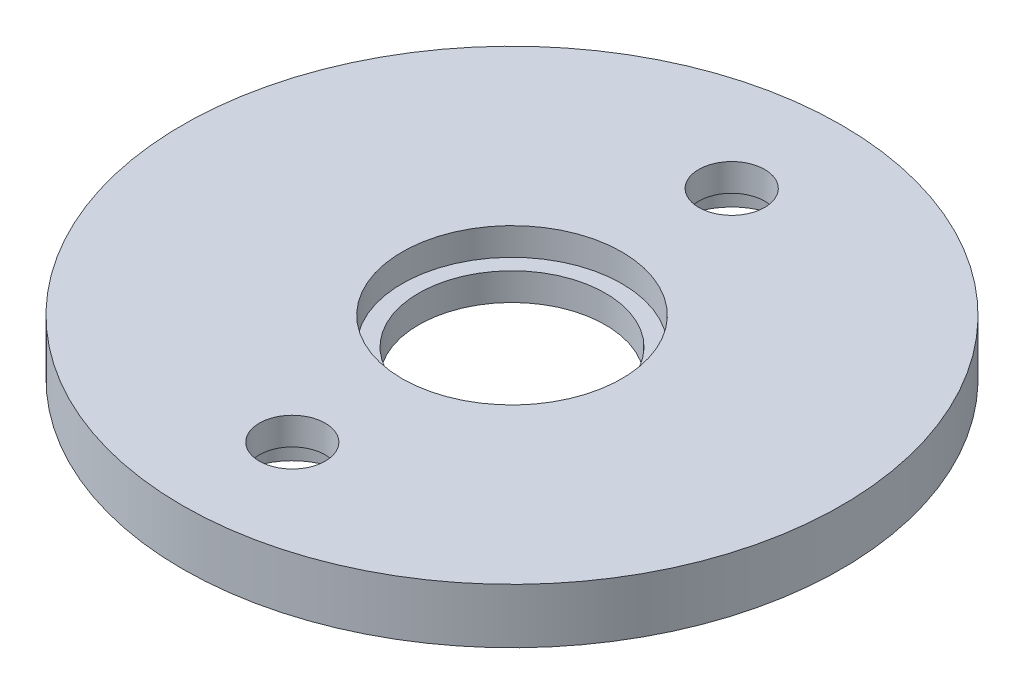
ISO-10303-21;
HEADER;
FILE_DESCRIPTION(('STEP AP214'),'2;1');
FILE_NAME('part.step','',(''),(''),'','','');
FILE_SCHEMA(('AUTOMOTIVE_DESIGN { 1 0 10303 214 1 1 1 1 }'));
ENDSEC;
DATA;
#1=APPLICATION_CONTEXT('core data for automotive mechanical design processes');
#2=APPLICATION_PROTOCOL_DEFINITION('international standard','automotive_design',2000,#1);
#3=PRODUCT_CONTEXT('',#1,'mechanical');
#4=PRODUCT('Part','Part','',(#3));
#5=PRODUCT_RELATED_PRODUCT_CATEGORY('part','',(#4));
#6=PRODUCT_DEFINITION_FORMATION('','',#4);
#7=PRODUCT_DEFINITION_CONTEXT('part definition',#1,'design');
#8=PRODUCT_DEFINITION('design','',#6,#7);
#9=PRODUCT_DEFINITION_SHAPE('','',#8);
#10=(LENGTH_UNIT() NAMED_UNIT(*) SI_UNIT(.MILLI.,.METRE.));
#11=(NAMED_UNIT(*) PLANE_ANGLE_UNIT() SI_UNIT($,.RADIAN.));
#12=(NAMED_UNIT(*) SI_UNIT($,.STERADIAN.) SOLID_ANGLE_UNIT());
#13=UNCERTAINTY_MEASURE_WITH_UNIT(LENGTH_MEASURE(1.E-05),#10,'distance_accuracy_value','');
#14=(GEOMETRIC_REPRESENTATION_CONTEXT(3) GLOBAL_UNCERTAINTY_ASSIGNED_CONTEXT((#13)) GLOBAL_UNIT_ASSIGNED_CONTEXT((#10,
#11,#12)) REPRESENTATION_CONTEXT('',''));
#15=CARTESIAN_POINT('',(0.,0.,0.));
#16=DIRECTION('',(0.,0.,1.));
#17=DIRECTION('',(1.,0.,0.));
#18=AXIS2_PLACEMENT_3D('',#15,#16,#17);
#19=CARTESIAN_POINT('',(0.,1.,0.));
#20=DIRECTION('',(0.,-1.,0.));
#21=DIRECTION('',(0.,0.,-1.));
#22=AXIS2_PLACEMENT_3D('',#19,#20,#21);
#23=CYLINDRICAL_SURFACE('',#22,1.7);
#24=CARTESIAN_POINT('',(0.,0.,0.));
#25=DIRECTION('',(0.,1.,0.));
#26=DIRECTION('',(0.,0.,1.));
#27=AXIS2_PLACEMENT_3D('',#24,#25,#26);
#28=CIRCLE('',#27,1.7);
#29=CARTESIAN_POINT('',(0.,0.,1.7));
#30=VERTEX_POINT('',#29);
#31=EDGE_CURVE('E56',#30,#30,#28,.T.);
#32=ORIENTED_EDGE('',*,*,#31,.F.);
#33=EDGE_LOOP('',(#32));
#34=FACE_BOUND('',#33,.T.);
#35=CARTESIAN_POINT('',(0.,0.5,0.));
#36=DIRECTION('',(0.,1.,0.));
#37=DIRECTION('',(0.,0.,1.));
#38=AXIS2_PLACEMENT_3D('',#35,#36,#37);
#39=CIRCLE('',#38,1.7);
#40=CARTESIAN_POINT('',(0.,0.5,1.7));
#41=VERTEX_POINT('',#40);
#42=EDGE_CURVE('E47',#41,#41,#39,.T.);
#43=ORIENTED_EDGE('',*,*,#42,.T.);
#44=EDGE_LOOP('',(#43));
#45=FACE_BOUND('',#44,.T.);
#46=ADVANCED_FACE('F44',(#34,#45),#23,.F.);
#47=CARTESIAN_POINT('',(0.,0.,0.));
#48=DIRECTION('',(0.,1.,0.));
#49=DIRECTION('',(0.,0.,1.));
#50=AXIS2_PLACEMENT_3D('',#47,#48,#49);
#51=PLANE('',#50);
#52=ORIENTED_EDGE('',*,*,#31,.T.);
#53=EDGE_LOOP('',(#52));
#54=FACE_BOUND('',#53,.T.);
#55=CARTESIAN_POINT('',(0.,0.,0.));
#56=DIRECTION('',(0.,1.,0.));
#57=DIRECTION('',(0.,0.,1.));
#58=AXIS2_PLACEMENT_3D('',#55,#56,#57);
#59=CIRCLE('',#58,6.);
#60=CARTESIAN_POINT('',(0.,0.,6.));
#61=VERTEX_POINT('',#60);
#62=EDGE_CURVE('E51',#61,#61,#59,.T.);
#63=ORIENTED_EDGE('',*,*,#62,.F.);
#64=EDGE_LOOP('',(#63));
#65=FACE_BOUND('',#64,.T.);
#66=CARTESIAN_POINT('',(0.,0.,-4.));
#67=DIRECTION('',(0.,1.,0.));
#68=DIRECTION('',(0.,0.,1.));
#69=AXIS2_PLACEMENT_3D('',#66,#67,#68);
#70=CIRCLE('',#69,1.);
#71=CARTESIAN_POINT('',(0.,0.,-3.));
#72=VERTEX_POINT('',#71);
#73=EDGE_CURVE('E71',#72,#72,#70,.T.);
#74=ORIENTED_EDGE('',*,*,#73,.T.);
#75=EDGE_LOOP('',(#74));
#76=FACE_BOUND('',#75,.T.);
#77=CARTESIAN_POINT('',(0.,0.,4.));
#78=DIRECTION('',(0.,1.,0.));
#79=DIRECTION('',(0.,0.,1.));
#80=AXIS2_PLACEMENT_3D('',#77,#78,#79);
#81=CIRCLE('',#80,1.);
#82=CARTESIAN_POINT('',(0.,0.,5.));
#83=VERTEX_POINT('',#82);
#84=EDGE_CURVE('E78',#83,#83,#81,.F.);
#85=ORIENTED_EDGE('',*,*,#84,.F.);
#86=EDGE_LOOP('',(#85));
#87=FACE_BOUND('',#86,.T.);
#88=ADVANCED_FACE('F101',(#54,#65,#76,#87),#51,.F.);
#89=CARTESIAN_POINT('',(0.,1.,0.));
#90=DIRECTION('',(0.,1.,0.));
#91=DIRECTION('',(0.,0.,1.));
#92=AXIS2_PLACEMENT_3D('',#89,#90,#91);
#93=PLANE('',#92);
#94=CARTESIAN_POINT('',(0.,1.,0.));
#95=DIRECTION('',(0.,1.,0.));
#96=DIRECTION('',(0.,0.,1.));
#97=AXIS2_PLACEMENT_3D('',#94,#95,#96);
#98=CIRCLE('',#97,2.);
#99=CARTESIAN_POINT('',(0.,1.,2.));
#100=VERTEX_POINT('',#99);
#101=EDGE_CURVE('E91',#100,#100,#98,.T.);
#102=ORIENTED_EDGE('',*,*,#101,.F.);
#103=EDGE_LOOP('',(#102));
#104=FACE_BOUND('',#103,.T.);
#105=CARTESIAN_POINT('',(0.,1.,-4.));
#106=DIRECTION('',(0.,1.,0.));
#107=DIRECTION('',(0.,0.,1.));
#108=AXIS2_PLACEMENT_3D('',#105,#106,#107);
#109=CIRCLE('',#108,0.6);
#110=CARTESIAN_POINT('',(0.,1.,-3.4));
#111=VERTEX_POINT('',#110);
#112=EDGE_CURVE('E59',#111,#111,#109,.T.);
#113=ORIENTED_EDGE('',*,*,#112,.F.);
#114=EDGE_LOOP('',(#113));
#115=FACE_BOUND('',#114,.T.);
#116=CARTESIAN_POINT('',(0.,1.,0.));
#117=DIRECTION('',(0.,1.,0.));
#118=DIRECTION('',(0.,0.,1.));
#119=AXIS2_PLACEMENT_3D('',#116,#117,#118);
#120=CIRCLE('',#119,6.);
#121=CARTESIAN_POINT('',(0.,1.,6.));
#122=VERTEX_POINT('',#121);
#123=EDGE_CURVE('E11',#122,#122,#120,.T.);
#124=ORIENTED_EDGE('',*,*,#123,.T.);
#125=EDGE_LOOP('',(#124));
#126=FACE_BOUND('',#125,.T.);
#127=CARTESIAN_POINT('',(0.,1.,4.));
#128=DIRECTION('',(0.,1.,0.));
#129=DIRECTION('',(0.,0.,1.));
#130=AXIS2_PLACEMENT_3D('',#127,#128,#129);
#131=CIRCLE('',#130,0.6);
#132=CARTESIAN_POINT('',(0.,1.,4.6));
#133=VERTEX_POINT('',#132);
#134=EDGE_CURVE('E62',#133,#133,#131,.F.);
#135=ORIENTED_EDGE('',*,*,#134,.T.);
#136=EDGE_LOOP('',(#135));
#137=FACE_BOUND('',#136,.T.);
#138=ADVANCED_FACE('F97',(#104,#115,#126,#137),#93,.T.);
#139=CARTESIAN_POINT('',(0.,1.,0.));
#140=DIRECTION('',(0.,-1.,0.));
#141=DIRECTION('',(0.,0.,-1.));
#142=AXIS2_PLACEMENT_3D('',#139,#140,#141);
#143=CYLINDRICAL_SURFACE('',#142,6.);
#144=ORIENTED_EDGE('',*,*,#123,.F.);
#145=EDGE_LOOP('',(#144));
#146=FACE_BOUND('',#145,.T.);
#147=ORIENTED_EDGE('',*,*,#62,.T.);
#148=EDGE_LOOP('',(#147));
#149=FACE_BOUND('',#148,.T.);
#150=ADVANCED_FACE('F100',(#146,#149),#143,.T.);
#151=CARTESIAN_POINT('',(0.,1.,-4.));
#152=DIRECTION('',(0.,-1.,0.));
#153=DIRECTION('',(0.,0.,-1.));
#154=AXIS2_PLACEMENT_3D('',#151,#152,#153);
#155=CYLINDRICAL_SURFACE('',#154,0.6);
#156=CARTESIAN_POINT('',(0.,0.5,-4.));
#157=DIRECTION('',(0.,1.,0.));
#158=DIRECTION('',(0.,0.,1.));
#159=AXIS2_PLACEMENT_3D('',#156,#157,#158);
#160=CIRCLE('',#159,0.6);
#161=CARTESIAN_POINT('',(0.,0.5,-3.4));
#162=VERTEX_POINT('',#161);
#163=EDGE_CURVE('E74',#162,#162,#160,.T.);
#164=ORIENTED_EDGE('',*,*,#163,.F.);
#165=EDGE_LOOP('',(#164));
#166=FACE_BOUND('',#165,.T.);
#167=ORIENTED_EDGE('',*,*,#112,.T.);
#168=EDGE_LOOP('',(#167));
#169=FACE_BOUND('',#168,.T.);
#170=ADVANCED_FACE('F105',(#166,#169),#155,.F.);
#171=CARTESIAN_POINT('',(0.,1.,4.));
#172=DIRECTION('',(0.,-1.,0.));
#173=DIRECTION('',(0.,0.,-1.));
#174=AXIS2_PLACEMENT_3D('',#171,#172,#173);
#175=CYLINDRICAL_SURFACE('',#174,0.6);
#176=CARTESIAN_POINT('',(0.,0.5,4.));
#177=DIRECTION('',(0.,1.,0.));
#178=DIRECTION('',(0.,0.,1.));
#179=AXIS2_PLACEMENT_3D('',#176,#177,#178);
#180=CIRCLE('',#179,0.6);
#181=CARTESIAN_POINT('',(0.,0.5,4.6));
#182=VERTEX_POINT('',#181);
#183=EDGE_CURVE('E69',#182,#182,#180,.F.);
#184=ORIENTED_EDGE('',*,*,#183,.T.);
#185=EDGE_LOOP('',(#184));
#186=FACE_BOUND('',#185,.T.);
#187=ORIENTED_EDGE('',*,*,#134,.F.);
#188=EDGE_LOOP('',(#187));
#189=FACE_BOUND('',#188,.T.);
#190=ADVANCED_FACE('F107',(#186,#189),#175,.F.);
#191=CARTESIAN_POINT('',(0.,0.5,4.));
#192=DIRECTION('',(0.,-1.,0.));
#193=DIRECTION('',(0.,0.,-1.));
#194=AXIS2_PLACEMENT_3D('',#191,#192,#193);
#195=CYLINDRICAL_SURFACE('',#194,1.);
#196=CARTESIAN_POINT('',(0.,0.5,4.));
#197=DIRECTION('',(0.,1.,0.));
#198=DIRECTION('',(0.,0.,1.));
#199=AXIS2_PLACEMENT_3D('',#196,#197,#198);
#200=CIRCLE('',#199,1.);
#201=CARTESIAN_POINT('',(0.,0.5,5.));
#202=VERTEX_POINT('',#201);
#203=EDGE_CURVE('E83',#202,#202,#200,.F.);
#204=ORIENTED_EDGE('',*,*,#203,.F.);
#205=EDGE_LOOP('',(#204));
#206=FACE_BOUND('',#205,.T.);
#207=ORIENTED_EDGE('',*,*,#84,.T.);
#208=EDGE_LOOP('',(#207));
#209=FACE_BOUND('',#208,.T.);
#210=ADVANCED_FACE('F114',(#206,#209),#195,.F.);
#211=CARTESIAN_POINT('',(0.,0.5,0.));
#212=DIRECTION('',(0.,1.,0.));
#213=DIRECTION('',(0.,0.,1.));
#214=AXIS2_PLACEMENT_3D('',#211,#212,#213);
#215=PLANE('',#214);
#216=ORIENTED_EDGE('',*,*,#203,.T.);
#217=EDGE_LOOP('',(#216));
#218=FACE_BOUND('',#217,.T.);
#219=ORIENTED_EDGE('',*,*,#183,.F.);
#220=EDGE_LOOP('',(#219));
#221=FACE_BOUND('',#220,.T.);
#222=ADVANCED_FACE('F145',(#218,#221),#215,.F.);
#223=CARTESIAN_POINT('',(0.,0.5,-4.));
#224=DIRECTION('',(0.,-1.,0.));
#225=DIRECTION('',(0.,0.,-1.));
#226=AXIS2_PLACEMENT_3D('',#223,#224,#225);
#227=CYLINDRICAL_SURFACE('',#226,1.);
#228=CARTESIAN_POINT('',(0.,0.5,-4.));
#229=DIRECTION('',(0.,1.,0.));
#230=DIRECTION('',(0.,0.,1.));
#231=AXIS2_PLACEMENT_3D('',#228,#229,#230);
#232=CIRCLE('',#231,1.);
#233=CARTESIAN_POINT('',(0.,0.5,-3.));
#234=VERTEX_POINT('',#233);
#235=EDGE_CURVE('E75',#234,#234,#232,.T.);
#236=ORIENTED_EDGE('',*,*,#235,.T.);
#237=EDGE_LOOP('',(#236));
#238=FACE_BOUND('',#237,.T.);
#239=ORIENTED_EDGE('',*,*,#73,.F.);
#240=EDGE_LOOP('',(#239));
#241=FACE_BOUND('',#240,.T.);
#242=ADVANCED_FACE('F141',(#238,#241),#227,.F.);
#243=CARTESIAN_POINT('',(0.,0.5,0.));
#244=DIRECTION('',(0.,1.,0.));
#245=DIRECTION('',(0.,0.,1.));
#246=AXIS2_PLACEMENT_3D('',#243,#244,#245);
#247=PLANE('',#246);
#248=ORIENTED_EDGE('',*,*,#163,.T.);
#249=EDGE_LOOP('',(#248));
#250=FACE_BOUND('',#249,.T.);
#251=ORIENTED_EDGE('',*,*,#235,.F.);
#252=EDGE_LOOP('',(#251));
#253=FACE_BOUND('',#252,.T.);
#254=ADVANCED_FACE('F137',(#250,#253),#247,.F.);
#255=CARTESIAN_POINT('',(0.,-5.65685424949238,0.));
#256=DIRECTION('',(0.,1.,0.));
#257=DIRECTION('',(0.,0.,1.));
#258=AXIS2_PLACEMENT_3D('',#255,#256,#257);
#259=CYLINDRICAL_SURFACE('',#258,2.);
#260=CARTESIAN_POINT('',(0.,0.5,0.));
#261=DIRECTION('',(0.,1.,0.));
#262=DIRECTION('',(0.,0.,1.));
#263=AXIS2_PLACEMENT_3D('',#260,#261,#262);
#264=CIRCLE('',#263,2.);
#265=CARTESIAN_POINT('',(0.,0.5,2.));
#266=VERTEX_POINT('',#265);
#267=EDGE_CURVE('E88',#266,#266,#264,.F.);
#268=ORIENTED_EDGE('',*,*,#267,.T.);
#269=EDGE_LOOP('',(#268));
#270=FACE_BOUND('',#269,.T.);
#271=ORIENTED_EDGE('',*,*,#101,.T.);
#272=EDGE_LOOP('',(#271));
#273=FACE_BOUND('',#272,.T.);
#274=ADVANCED_FACE('F95',(#270,#273),#259,.F.);
#275=CARTESIAN_POINT('',(0.,0.5,0.));
#276=DIRECTION('',(0.,1.,0.));
#277=DIRECTION('',(0.,0.,1.));
#278=AXIS2_PLACEMENT_3D('',#275,#276,#277);
#279=PLANE('',#278);
#280=ORIENTED_EDGE('',*,*,#42,.F.);
#281=EDGE_LOOP('',(#280));
#282=FACE_BOUND('',#281,.T.);
#283=ORIENTED_EDGE('',*,*,#267,.F.);
#284=EDGE_LOOP('',(#283));
#285=FACE_BOUND('',#284,.T.);
#286=ADVANCED_FACE('F130',(#282,#285),#279,.T.);
#287=CLOSED_SHELL('',(#46,#88,#138,#150,#170,#190,#210,#222,#242,#254,#274,#286));
#288=MANIFOLD_SOLID_BREP('B2',#287);
#289=ADVANCED_BREP_SHAPE_REPRESENTATION('',(#18,#288),#14);
#290=SHAPE_DEFINITION_REPRESENTATION(#9,#289);
ENDSEC;
END-ISO-10303-21;
